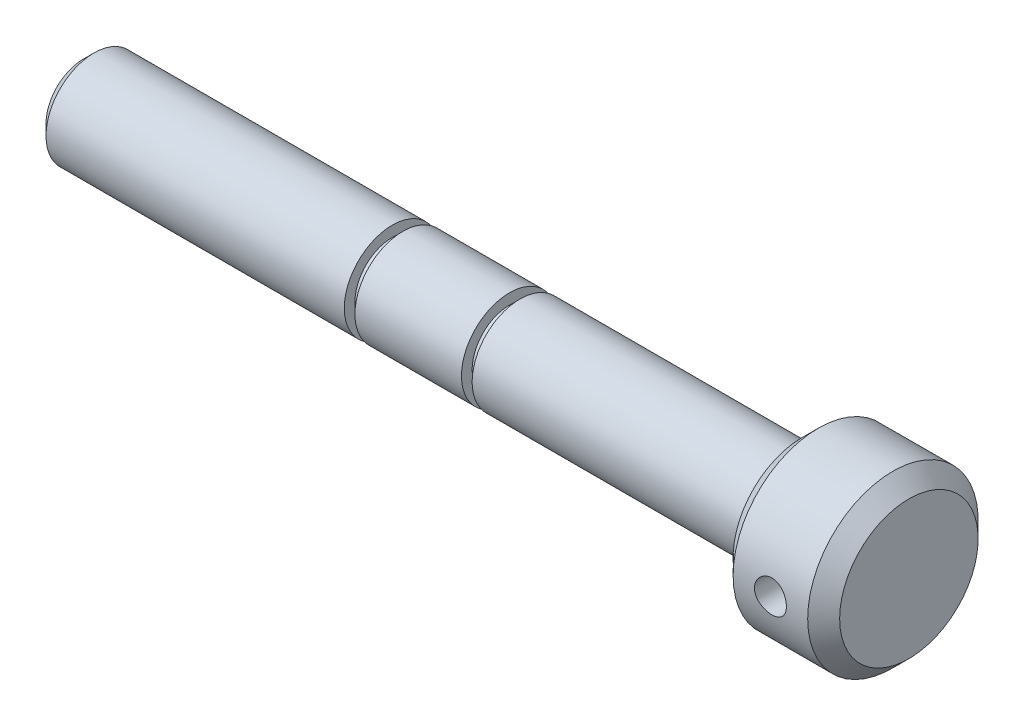
ISO-10303-21;
HEADER;
FILE_DESCRIPTION(('STEP AP214'),'2;1');
FILE_NAME('part.step','',(''),(''),'','','');
FILE_SCHEMA(('AUTOMOTIVE_DESIGN { 1 0 10303 214 1 1 1 1 }'));
ENDSEC;
DATA;
#1=APPLICATION_CONTEXT('core data for automotive mechanical design processes');
#2=APPLICATION_PROTOCOL_DEFINITION('international standard','automotive_design',2000,#1);
#3=PRODUCT_CONTEXT('',#1,'mechanical');
#4=PRODUCT('Part','Part','',(#3));
#5=PRODUCT_RELATED_PRODUCT_CATEGORY('part','',(#4));
#6=PRODUCT_DEFINITION_FORMATION('','',#4);
#7=PRODUCT_DEFINITION_CONTEXT('part definition',#1,'design');
#8=PRODUCT_DEFINITION('design','',#6,#7);
#9=PRODUCT_DEFINITION_SHAPE('','',#8);
#10=(LENGTH_UNIT() NAMED_UNIT(*) SI_UNIT(.MILLI.,.METRE.));
#11=(NAMED_UNIT(*) PLANE_ANGLE_UNIT() SI_UNIT($,.RADIAN.));
#12=(NAMED_UNIT(*) SI_UNIT($,.STERADIAN.) SOLID_ANGLE_UNIT());
#13=UNCERTAINTY_MEASURE_WITH_UNIT(LENGTH_MEASURE(1.E-05),#10,'distance_accuracy_value','');
#14=(GEOMETRIC_REPRESENTATION_CONTEXT(3) GLOBAL_UNCERTAINTY_ASSIGNED_CONTEXT((#13)) GLOBAL_UNIT_ASSIGNED_CONTEXT((#10,
#11,#12)) REPRESENTATION_CONTEXT('',''));
#15=CARTESIAN_POINT('',(0.,0.,0.));
#16=DIRECTION('',(0.,0.,1.));
#17=DIRECTION('',(1.,0.,0.));
#18=AXIS2_PLACEMENT_3D('',#15,#16,#17);
#19=CARTESIAN_POINT('',(155.,0.,0.));
#20=DIRECTION('',(-1.,0.,0.));
#21=DIRECTION('',(0.,0.,1.));
#22=AXIS2_PLACEMENT_3D('',#19,#20,#21);
#23=PLANE('',#22);
#24=CARTESIAN_POINT('',(155.,0.,0.));
#25=DIRECTION('',(-1.,0.,0.));
#26=DIRECTION('',(0.,0.,1.));
#27=AXIS2_PLACEMENT_3D('',#24,#25,#26);
#28=CIRCLE('',#27,13.);
#29=CARTESIAN_POINT('',(155.,0.,13.));
#30=VERTEX_POINT('',#29);
#31=EDGE_CURVE('E153',#30,#30,#28,.F.);
#32=ORIENTED_EDGE('',*,*,#31,.T.);
#33=EDGE_LOOP('',(#32));
#34=FACE_BOUND('',#33,.T.);
#35=ADVANCED_FACE('F45',(#34),#23,.F.);
#36=CARTESIAN_POINT('',(0.,0.,0.));
#37=DIRECTION('',(-1.,0.,0.));
#38=DIRECTION('',(0.,0.,1.));
#39=AXIS2_PLACEMENT_3D('',#36,#37,#38);
#40=CYLINDRICAL_SURFACE('',#39,16.);
#41=CARTESIAN_POINT('',(148.,0.,-16.));
#42=CARTESIAN_POINT('',(147.999993620823,0.166943492930942,-15.999996976677));
#43=CARTESIAN_POINT('',(147.986017846761,0.333969985460197,-15.9973601984343));
#44=CARTESIAN_POINT('',(147.930520009763,0.663316259683595,-15.9870957178104));
#45=CARTESIAN_POINT('',(147.88897469872,0.825631948304451,-15.9794638033379));
#46=CARTESIAN_POINT('',(147.779654597481,1.14074592370361,-15.9600627753092));
#47=CARTESIAN_POINT('',(147.711903495095,1.2935526613707,-15.9482973989297));
#48=CARTESIAN_POINT('',(147.552162246154,1.58561594618802,-15.9219142119957));
#49=CARTESIAN_POINT('',(147.46017406171,1.72487358895465,-15.9072966323658));
#50=CARTESIAN_POINT('',(147.253400463993,1.98756743186101,-15.8766267286101));
#51=CARTESIAN_POINT('',(147.13838111066,2.11081791006367,-15.860560697127));
#52=CARTESIAN_POINT('',(146.889313381825,2.33639212270738,-15.828906369173));
#53=CARTESIAN_POINT('',(146.755263640461,2.43871435378483,-15.8133181070906));
#54=CARTESIAN_POINT('',(146.470627823272,2.62029997331585,-15.7842510249001));
#55=CARTESIAN_POINT('',(146.319919259365,2.6993744393921,-15.7707898777236));
#56=CARTESIAN_POINT('',(146.007062169646,2.83101048664565,-15.7476942642397));
#57=CARTESIAN_POINT('',(145.844914631778,2.88357435426196,-15.7380594679392));
#58=CARTESIAN_POINT('',(145.515769538171,2.96010107007,-15.723845391491));
#59=CARTESIAN_POINT('',(145.348849805593,2.98438780384078,-15.7192089073281));
#60=CARTESIAN_POINT('',(145.013245230383,3.00467616190692,-15.7153439430552));
#61=CARTESIAN_POINT('',(144.844560547395,3.00068032270747,-15.7161149779752));
#62=CARTESIAN_POINT('',(144.512560949468,2.96477959204724,-15.7229258540351));
#63=CARTESIAN_POINT('',(144.3492045714,2.93324299992089,-15.7288961629467));
#64=CARTESIAN_POINT('',(144.030143160435,2.84373598792413,-15.7453236656933));
#65=CARTESIAN_POINT('',(143.874438452981,2.78576444478997,-15.7557810501903));
#66=CARTESIAN_POINT('',(143.574022641999,2.64467294358599,-15.7800771058518));
#67=CARTESIAN_POINT('',(143.429383058838,2.56140427064911,-15.7939356764673));
#68=CARTESIAN_POINT('',(143.15599054292,2.37218737860832,-15.8234594320584));
#69=CARTESIAN_POINT('',(143.02723922457,2.26623685778531,-15.8391248003104));
#70=CARTESIAN_POINT('',(142.787150088655,2.03267811370594,-15.8708000254433));
#71=CARTESIAN_POINT('',(142.676118695096,1.90475487372136,-15.8868114204806));
#72=CARTESIAN_POINT('',(142.477045518649,1.63193607419766,-15.9171477221664));
#73=CARTESIAN_POINT('',(142.389003966259,1.48704034451154,-15.9314726119049));
#74=CARTESIAN_POINT('',(142.23836449226,1.18406997774933,-15.9568507935502));
#75=CARTESIAN_POINT('',(142.175798441764,1.02597912889298,-15.9678999827258));
#76=CARTESIAN_POINT('',(142.078195813816,0.701278230797383,-15.9854501080544));
#77=CARTESIAN_POINT('',(142.043156311909,0.534669088555564,-15.9919515273599));
#78=CARTESIAN_POINT('',(142.002027937963,0.200297305806761,-15.9996072128396));
#79=CARTESIAN_POINT('',(141.99551921694,0.032588025268261,-16.0008390182456));
#80=CARTESIAN_POINT('',(142.010510959095,-0.301522496184375,-15.9980308719646));
#81=CARTESIAN_POINT('',(142.03201004613,-0.467923800960776,-15.9939911792886));
#82=CARTESIAN_POINT('',(142.102058070367,-0.793363146436439,-15.9811422300081));
#83=CARTESIAN_POINT('',(142.150394565076,-0.952448522092132,-15.9723704474806));
#84=CARTESIAN_POINT('',(142.272515413558,-1.26025726364927,-15.95103684425));
#85=CARTESIAN_POINT('',(142.346301495132,-1.4089799251902,-15.9384747662267));
#86=CARTESIAN_POINT('',(142.518156256319,-1.69363334302642,-15.9107606071533));
#87=CARTESIAN_POINT('',(142.616481477074,-1.82940655403024,-15.8955817234913));
#88=CARTESIAN_POINT('',(142.834276274725,-2.08267664652909,-15.8643868697942));
#89=CARTESIAN_POINT('',(142.953747826003,-2.20017181952174,-15.8483708216937));
#90=CARTESIAN_POINT('',(143.212344637823,-2.41514591744096,-15.817049513949));
#91=CARTESIAN_POINT('',(143.351709816251,-2.51233832437154,-15.8017565172051));
#92=CARTESIAN_POINT('',(143.645035249047,-2.68193350115574,-15.7738597115706));
#93=CARTESIAN_POINT('',(143.798994960741,-2.75433719227848,-15.761255802747));
#94=CARTESIAN_POINT('',(144.116411734485,-2.87189347025646,-15.7402604841915));
#95=CARTESIAN_POINT('',(144.279818759119,-2.91717737589572,-15.7318488087376));
#96=CARTESIAN_POINT('',(144.612094445043,-2.9796135865247,-15.7201440760483));
#97=CARTESIAN_POINT('',(144.780962487941,-2.99676906541416,-15.7168504413158));
#98=CARTESIAN_POINT('',(145.116496662883,-3.00235524296709,-15.7157839960771));
#99=CARTESIAN_POINT('',(145.283155161914,-2.99123790006997,-15.7179243194859));
#100=CARTESIAN_POINT('',(145.612182844091,-2.94158350757605,-15.7272920132));
#101=CARTESIAN_POINT('',(145.774552052855,-2.90304662178663,-15.7345193531149));
#102=CARTESIAN_POINT('',(146.090148969591,-2.79983775166526,-15.7532101604636));
#103=CARTESIAN_POINT('',(146.243393182691,-2.73521470794505,-15.7646656918993));
#104=CARTESIAN_POINT('',(146.536936508482,-2.58171737824409,-15.7905277510368));
#105=CARTESIAN_POINT('',(146.67723470569,-2.49284137896372,-15.8049344872024));
#106=CARTESIAN_POINT('',(146.943167360085,-2.29178974679071,-15.8353453221549));
#107=CARTESIAN_POINT('',(147.068550825134,-2.17928519728607,-15.8513701070609));
#108=CARTESIAN_POINT('',(147.298810324929,-1.93485585348458,-15.8830566783747));
#109=CARTESIAN_POINT('',(147.40368164196,-1.80292660378324,-15.8987183805466));
#110=CARTESIAN_POINT('',(147.590821905254,-1.52196989014375,-15.928079519361));
#111=CARTESIAN_POINT('',(147.672878856981,-1.37279918128103,-15.9417600198112));
#112=CARTESIAN_POINT('',(147.81063527321,-1.06258022730767,-15.9654323876137));
#113=CARTESIAN_POINT('',(147.866359494094,-0.901543303410499,-15.9754277175807));
#114=CARTESIAN_POINT('',(147.938554628837,-0.616694405650313,-15.9885658141526));
#115=CARTESIAN_POINT('',(147.961557260626,-0.494547620503746,-15.9928294175641));
#116=CARTESIAN_POINT('',(147.992282124233,-0.248282494230318,-15.9985475990802));
#117=CARTESIAN_POINT('',(148.000004744512,-0.12416420330542,-16.0000022485961));
#118=CARTESIAN_POINT('',(148.,0.,-16.));
#119=B_SPLINE_CURVE_WITH_KNOTS('',3,(#41,#42,#43,#44,#45,#46,#47,#48,#49,#50,#51,#52,#53,#54,
#55,#56,#57,#58,#59,#60,#61,#62,#63,#64,#65,#66,#67,#68,#69,#70,#71,#72,#73,#74,#75,#76,#77,#78,
#79,#80,#81,#82,#83,#84,#85,#86,#87,#88,#89,#90,#91,#92,#93,#94,#95,#96,#97,#98,#99,#100,#101,
#102,#103,#104,#105,#106,#107,#108,#109,#110,#111,#112,#113,#114,#115,#116,#117,#118),
.UNSPECIFIED.,.T.,.F.,(4,2,2,2,2,2,2,2,2,2,2,2,2,2,2,2,2,2,2,2,2,2,2,2,2,2,2,2,2,2,2,2,2,2,2,2,
2,2,4),(0.,0.50037640192985,1.0011752850709,1.50152254246182,2.00182930673783,2.50750236027263,
3.01321172567232,3.52292381008715,4.03259192623896,4.53636302890672,5.04008895174511,
5.53718001225533,6.03429219693572,6.53438525259059,7.03452908099719,7.54255536928152,
8.05058675089894,8.55925176643396,9.0678627334749,9.56896348152192,10.0700396092917,
10.5672046781565,11.0644035067606,11.5670355603541,12.069714568262,12.579068739746,
13.0884039790989,13.5952525563712,14.1020439389302,14.6007850446349,15.0995231708301,
15.5973299241538,16.0951718531084,16.6004673993276,17.1058790252451,17.6158409783263,
18.1253225386234,18.4974868904881,18.8696417807908),.UNSPECIFIED.);
#120=CARTESIAN_POINT('',(148.,0.,-16.));
#121=VERTEX_POINT('',#120);
#122=EDGE_CURVE('E10',#121,#121,#119,.T.);
#123=ORIENTED_EDGE('',*,*,#122,.T.);
#124=EDGE_LOOP('',(#123));
#125=FACE_BOUND('',#124,.T.);
#126=CARTESIAN_POINT('',(148.,0.,16.));
#127=CARTESIAN_POINT('',(147.999993620823,-0.166943492930942,15.999996976677));
#128=CARTESIAN_POINT('',(147.986017846761,-0.333969985460197,15.9973601984343));
#129=CARTESIAN_POINT('',(147.930520009763,-0.663316259683595,15.9870957178104));
#130=CARTESIAN_POINT('',(147.88897469872,-0.825631948304451,15.9794638033379));
#131=CARTESIAN_POINT('',(147.779654597481,-1.14074592370361,15.9600627753092));
#132=CARTESIAN_POINT('',(147.711903495095,-1.2935526613707,15.9482973989297));
#133=CARTESIAN_POINT('',(147.552162246154,-1.58561594618802,15.9219142119957));
#134=CARTESIAN_POINT('',(147.46017406171,-1.72487358895465,15.9072966323658));
#135=CARTESIAN_POINT('',(147.253400463993,-1.98756743186101,15.8766267286101));
#136=CARTESIAN_POINT('',(147.13838111066,-2.11081791006367,15.860560697127));
#137=CARTESIAN_POINT('',(146.889313381825,-2.33639212270738,15.828906369173));
#138=CARTESIAN_POINT('',(146.755263640461,-2.43871435378483,15.8133181070906));
#139=CARTESIAN_POINT('',(146.470627823272,-2.62029997331585,15.7842510249001));
#140=CARTESIAN_POINT('',(146.319919259365,-2.6993744393921,15.7707898777236));
#141=CARTESIAN_POINT('',(146.007062169646,-2.83101048664565,15.7476942642397));
#142=CARTESIAN_POINT('',(145.844914631778,-2.88357435426196,15.7380594679392));
#143=CARTESIAN_POINT('',(145.515769538171,-2.96010107007,15.723845391491));
#144=CARTESIAN_POINT('',(145.348849805593,-2.98438780384078,15.7192089073281));
#145=CARTESIAN_POINT('',(145.013245230383,-3.00467616190692,15.7153439430552));
#146=CARTESIAN_POINT('',(144.844560547395,-3.00068032270747,15.7161149779752));
#147=CARTESIAN_POINT('',(144.512560949468,-2.96477959204724,15.7229258540351));
#148=CARTESIAN_POINT('',(144.3492045714,-2.93324299992089,15.7288961629467));
#149=CARTESIAN_POINT('',(144.030143160435,-2.84373598792413,15.7453236656933));
#150=CARTESIAN_POINT('',(143.874438452981,-2.78576444478997,15.7557810501903));
#151=CARTESIAN_POINT('',(143.574022641999,-2.64467294358599,15.7800771058518));
#152=CARTESIAN_POINT('',(143.429383058838,-2.56140427064911,15.7939356764673));
#153=CARTESIAN_POINT('',(143.15599054292,-2.37218737860832,15.8234594320584));
#154=CARTESIAN_POINT('',(143.02723922457,-2.26623685778531,15.8391248003104));
#155=CARTESIAN_POINT('',(142.787150088655,-2.03267811370594,15.8708000254433));
#156=CARTESIAN_POINT('',(142.676118695096,-1.90475487372136,15.8868114204806));
#157=CARTESIAN_POINT('',(142.477045518649,-1.63193607419766,15.9171477221664));
#158=CARTESIAN_POINT('',(142.389003966259,-1.48704034451154,15.9314726119049));
#159=CARTESIAN_POINT('',(142.23836449226,-1.18406997774933,15.9568507935502));
#160=CARTESIAN_POINT('',(142.175798441764,-1.02597912889298,15.9678999827258));
#161=CARTESIAN_POINT('',(142.078195813816,-0.701278230797383,15.9854501080544));
#162=CARTESIAN_POINT('',(142.043156311909,-0.534669088555564,15.9919515273599));
#163=CARTESIAN_POINT('',(142.002027937963,-0.200297305806761,15.9996072128396));
#164=CARTESIAN_POINT('',(141.99551921694,-0.032588025268261,16.0008390182456));
#165=CARTESIAN_POINT('',(142.010510959095,0.301522496184375,15.9980308719646));
#166=CARTESIAN_POINT('',(142.03201004613,0.467923800960776,15.9939911792886));
#167=CARTESIAN_POINT('',(142.102058070367,0.793363146436439,15.9811422300081));
#168=CARTESIAN_POINT('',(142.150394565076,0.952448522092132,15.9723704474806));
#169=CARTESIAN_POINT('',(142.272515413558,1.26025726364927,15.95103684425));
#170=CARTESIAN_POINT('',(142.346301495132,1.4089799251902,15.9384747662267));
#171=CARTESIAN_POINT('',(142.518156256319,1.69363334302642,15.9107606071533));
#172=CARTESIAN_POINT('',(142.616481477074,1.82940655403024,15.8955817234913));
#173=CARTESIAN_POINT('',(142.834276274725,2.08267664652909,15.8643868697942));
#174=CARTESIAN_POINT('',(142.953747826003,2.20017181952174,15.8483708216937));
#175=CARTESIAN_POINT('',(143.212344637823,2.41514591744096,15.817049513949));
#176=CARTESIAN_POINT('',(143.351709816251,2.51233832437154,15.8017565172051));
#177=CARTESIAN_POINT('',(143.645035249047,2.68193350115574,15.7738597115706));
#178=CARTESIAN_POINT('',(143.798994960741,2.75433719227848,15.761255802747));
#179=CARTESIAN_POINT('',(144.116411734485,2.87189347025646,15.7402604841915));
#180=CARTESIAN_POINT('',(144.279818759119,2.91717737589572,15.7318488087376));
#181=CARTESIAN_POINT('',(144.612094445043,2.9796135865247,15.7201440760483));
#182=CARTESIAN_POINT('',(144.780962487941,2.99676906541416,15.7168504413158));
#183=CARTESIAN_POINT('',(145.116496662883,3.00235524296709,15.7157839960771));
#184=CARTESIAN_POINT('',(145.283155161914,2.99123790006997,15.7179243194859));
#185=CARTESIAN_POINT('',(145.612182844091,2.94158350757605,15.7272920132));
#186=CARTESIAN_POINT('',(145.774552052855,2.90304662178663,15.7345193531149));
#187=CARTESIAN_POINT('',(146.090148969591,2.79983775166526,15.7532101604636));
#188=CARTESIAN_POINT('',(146.243393182691,2.73521470794505,15.7646656918993));
#189=CARTESIAN_POINT('',(146.536936508482,2.58171737824409,15.7905277510368));
#190=CARTESIAN_POINT('',(146.67723470569,2.49284137896372,15.8049344872024));
#191=CARTESIAN_POINT('',(146.943167360085,2.29178974679071,15.8353453221549));
#192=CARTESIAN_POINT('',(147.068550825134,2.17928519728607,15.8513701070609));
#193=CARTESIAN_POINT('',(147.298810324929,1.93485585348458,15.8830566783747));
#194=CARTESIAN_POINT('',(147.40368164196,1.80292660378324,15.8987183805466));
#195=CARTESIAN_POINT('',(147.590821905254,1.52196989014375,15.928079519361));
#196=CARTESIAN_POINT('',(147.672878856981,1.37279918128103,15.9417600198112));
#197=CARTESIAN_POINT('',(147.81063527321,1.06258022730767,15.9654323876137));
#198=CARTESIAN_POINT('',(147.866359494094,0.901543303410499,15.9754277175807));
#199=CARTESIAN_POINT('',(147.938554628837,0.616694405650313,15.9885658141526));
#200=CARTESIAN_POINT('',(147.961557260626,0.494547620503746,15.9928294175641));
#201=CARTESIAN_POINT('',(147.992282124233,0.248282494230318,15.9985475990802));
#202=CARTESIAN_POINT('',(148.000004744512,0.12416420330542,16.0000022485961));
#203=CARTESIAN_POINT('',(148.,0.,16.));
#204=B_SPLINE_CURVE_WITH_KNOTS('',3,(#126,#127,#128,#129,#130,#131,#132,#133,#134,#135,#136,
#137,#138,#139,#140,#141,#142,#143,#144,#145,#146,#147,#148,#149,#150,#151,#152,#153,#154,#155,
#156,#157,#158,#159,#160,#161,#162,#163,#164,#165,#166,#167,#168,#169,#170,#171,#172,#173,#174,
#175,#176,#177,#178,#179,#180,#181,#182,#183,#184,#185,#186,#187,#188,#189,#190,#191,#192,#193,
#194,#195,#196,#197,#198,#199,#200,#201,#202,#203),.UNSPECIFIED.,.T.,.F.,(4,2,2,2,2,2,2,2,2,2,2,
2,2,2,2,2,2,2,2,2,2,2,2,2,2,2,2,2,2,2,2,2,2,2,2,2,2,2,4),(0.,0.50037640192985,1.0011752850709,
1.50152254246182,2.00182930673783,2.50750236027263,3.01321172567232,3.52292381008715,
4.03259192623896,4.53636302890672,5.04008895174511,5.53718001225533,6.03429219693572,
6.53438525259059,7.03452908099719,7.54255536928152,8.05058675089894,8.55925176643396,
9.0678627334749,9.56896348152192,10.0700396092917,10.5672046781565,11.0644035067606,
11.5670355603541,12.069714568262,12.579068739746,13.0884039790989,13.5952525563712,
14.1020439389302,14.6007850446349,15.0995231708301,15.5973299241538,16.0951718531084,
16.6004673993276,17.1058790252451,17.6158409783263,18.1253225386234,18.4974868904881,
18.8696417807908),.UNSPECIFIED.);
#205=CARTESIAN_POINT('',(148.,0.,16.));
#206=VERTEX_POINT('',#205);
#207=EDGE_CURVE('E58',#206,#206,#204,.T.);
#208=ORIENTED_EDGE('',*,*,#207,.T.);
#209=EDGE_LOOP('',(#208));
#210=FACE_BOUND('',#209,.T.);
#211=CARTESIAN_POINT('',(138.,0.,0.));
#212=DIRECTION('',(1.,0.,0.));
#213=DIRECTION('',(0.,0.,-1.));
#214=AXIS2_PLACEMENT_3D('',#211,#212,#213);
#215=CIRCLE('',#214,16.);
#216=CARTESIAN_POINT('',(138.,0.,-16.));
#217=VERTEX_POINT('',#216);
#218=EDGE_CURVE('E158',#217,#217,#215,.T.);
#219=ORIENTED_EDGE('',*,*,#218,.T.);
#220=EDGE_LOOP('',(#219));
#221=FACE_BOUND('',#220,.T.);
#222=CARTESIAN_POINT('',(152.,0.,0.));
#223=DIRECTION('',(-1.,0.,0.));
#224=DIRECTION('',(0.,0.,1.));
#225=AXIS2_PLACEMENT_3D('',#222,#223,#224);
#226=CIRCLE('',#225,16.);
#227=CARTESIAN_POINT('',(152.,0.,16.));
#228=VERTEX_POINT('',#227);
#229=EDGE_CURVE('E156',#228,#228,#226,.T.);
#230=ORIENTED_EDGE('',*,*,#229,.T.);
#231=EDGE_LOOP('',(#230));
#232=FACE_BOUND('',#231,.T.);
#233=ADVANCED_FACE('F72',(#125,#210,#221,#232),#40,.T.);
#234=CARTESIAN_POINT('',(135.,16.,0.));
#235=DIRECTION('',(1.,0.,0.));
#236=DIRECTION('',(0.,0.,-1.));
#237=AXIS2_PLACEMENT_3D('',#234,#235,#236);
#238=PLANE('',#237);
#239=CARTESIAN_POINT('',(135.,0.,0.));
#240=DIRECTION('',(1.,0.,0.));
#241=DIRECTION('',(0.,0.,-1.));
#242=AXIS2_PLACEMENT_3D('',#239,#240,#241);
#243=CIRCLE('',#242,13.);
#244=CARTESIAN_POINT('',(135.,0.,-13.));
#245=VERTEX_POINT('',#244);
#246=EDGE_CURVE('E159',#245,#245,#243,.F.);
#247=ORIENTED_EDGE('',*,*,#246,.T.);
#248=EDGE_LOOP('',(#247));
#249=FACE_BOUND('',#248,.T.);
#250=CARTESIAN_POINT('',(135.,0.,0.));
#251=DIRECTION('',(-1.,0.,0.));
#252=DIRECTION('',(0.,0.,1.));
#253=AXIS2_PLACEMENT_3D('',#250,#251,#252);
#254=CIRCLE('',#253,9.00000000000002);
#255=CARTESIAN_POINT('',(135.,0.,9.00000000000002));
#256=VERTEX_POINT('',#255);
#257=EDGE_CURVE('E163',#256,#256,#254,.T.);
#258=ORIENTED_EDGE('',*,*,#257,.F.);
#259=EDGE_LOOP('',(#258));
#260=FACE_BOUND('',#259,.T.);
#261=ADVANCED_FACE('F121',(#249,#260),#238,.F.);
#262=CARTESIAN_POINT('',(0.,0.,0.));
#263=DIRECTION('',(-1.,0.,0.));
#264=DIRECTION('',(0.,0.,1.));
#265=AXIS2_PLACEMENT_3D('',#262,#263,#264);
#266=CYLINDRICAL_SURFACE('',#265,9.00000000000001);
#267=CARTESIAN_POINT('',(82.,0.,0.));
#268=DIRECTION('',(-1.,0.,0.));
#269=DIRECTION('',(0.,0.,1.));
#270=AXIS2_PLACEMENT_3D('',#267,#268,#269);
#271=CIRCLE('',#270,9.00000000000001);
#272=CARTESIAN_POINT('',(82.,0.,9.00000000000001));
#273=VERTEX_POINT('',#272);
#274=EDGE_CURVE('E172',#273,#273,#271,.T.);
#275=ORIENTED_EDGE('',*,*,#274,.F.);
#276=EDGE_LOOP('',(#275));
#277=FACE_BOUND('',#276,.T.);
#278=ORIENTED_EDGE('',*,*,#257,.T.);
#279=EDGE_LOOP('',(#278));
#280=FACE_BOUND('',#279,.T.);
#281=ADVANCED_FACE('F118',(#277,#280),#266,.T.);
#282=CARTESIAN_POINT('',(82.,9.00000000000001,0.));
#283=DIRECTION('',(1.,0.,0.));
#284=DIRECTION('',(0.,0.,-1.));
#285=AXIS2_PLACEMENT_3D('',#282,#283,#284);
#286=PLANE('',#285);
#287=CARTESIAN_POINT('',(82.,0.,0.));
#288=DIRECTION('',(-1.,0.,0.));
#289=DIRECTION('',(0.,0.,1.));
#290=AXIS2_PLACEMENT_3D('',#287,#288,#289);
#291=CIRCLE('',#290,7.);
#292=CARTESIAN_POINT('',(82.,0.,7.));
#293=VERTEX_POINT('',#292);
#294=EDGE_CURVE('E175',#293,#293,#291,.T.);
#295=ORIENTED_EDGE('',*,*,#294,.F.);
#296=EDGE_LOOP('',(#295));
#297=FACE_BOUND('',#296,.T.);
#298=ORIENTED_EDGE('',*,*,#274,.T.);
#299=EDGE_LOOP('',(#298));
#300=FACE_BOUND('',#299,.T.);
#301=ADVANCED_FACE('F114',(#297,#300),#286,.F.);
#302=CARTESIAN_POINT('',(0.,0.,0.));
#303=DIRECTION('',(-1.,0.,0.));
#304=DIRECTION('',(0.,0.,1.));
#305=AXIS2_PLACEMENT_3D('',#302,#303,#304);
#306=CYLINDRICAL_SURFACE('',#305,7.);
#307=CARTESIAN_POINT('',(80.,0.,0.));
#308=DIRECTION('',(-1.,0.,0.));
#309=DIRECTION('',(0.,0.,1.));
#310=AXIS2_PLACEMENT_3D('',#307,#308,#309);
#311=CIRCLE('',#310,7.);
#312=CARTESIAN_POINT('',(80.,0.,7.));
#313=VERTEX_POINT('',#312);
#314=EDGE_CURVE('E178',#313,#313,#311,.T.);
#315=ORIENTED_EDGE('',*,*,#314,.F.);
#316=EDGE_LOOP('',(#315));
#317=FACE_BOUND('',#316,.T.);
#318=ORIENTED_EDGE('',*,*,#294,.T.);
#319=EDGE_LOOP('',(#318));
#320=FACE_BOUND('',#319,.T.);
#321=ADVANCED_FACE('F110',(#317,#320),#306,.T.);
#322=CARTESIAN_POINT('',(80.,7.,0.));
#323=DIRECTION('',(-1.,0.,0.));
#324=DIRECTION('',(0.,0.,1.));
#325=AXIS2_PLACEMENT_3D('',#322,#323,#324);
#326=PLANE('',#325);
#327=CARTESIAN_POINT('',(80.,0.,0.));
#328=DIRECTION('',(-1.,0.,0.));
#329=DIRECTION('',(0.,0.,1.));
#330=AXIS2_PLACEMENT_3D('',#327,#328,#329);
#331=CIRCLE('',#330,9.00000000000001);
#332=CARTESIAN_POINT('',(80.,0.,9.00000000000001));
#333=VERTEX_POINT('',#332);
#334=EDGE_CURVE('E181',#333,#333,#331,.T.);
#335=ORIENTED_EDGE('',*,*,#334,.F.);
#336=EDGE_LOOP('',(#335));
#337=FACE_BOUND('',#336,.T.);
#338=ORIENTED_EDGE('',*,*,#314,.T.);
#339=EDGE_LOOP('',(#338));
#340=FACE_BOUND('',#339,.T.);
#341=ADVANCED_FACE('F106',(#337,#340),#326,.F.);
#342=CARTESIAN_POINT('',(0.,0.,0.));
#343=DIRECTION('',(-1.,0.,0.));
#344=DIRECTION('',(0.,0.,1.));
#345=AXIS2_PLACEMENT_3D('',#342,#343,#344);
#346=CYLINDRICAL_SURFACE('',#345,9.00000000000001);
#347=CARTESIAN_POINT('',(60.,0.,0.));
#348=DIRECTION('',(-1.,0.,0.));
#349=DIRECTION('',(0.,0.,1.));
#350=AXIS2_PLACEMENT_3D('',#347,#348,#349);
#351=CIRCLE('',#350,9.00000000000001);
#352=CARTESIAN_POINT('',(60.,0.,9.00000000000001));
#353=VERTEX_POINT('',#352);
#354=EDGE_CURVE('E184',#353,#353,#351,.T.);
#355=ORIENTED_EDGE('',*,*,#354,.F.);
#356=EDGE_LOOP('',(#355));
#357=FACE_BOUND('',#356,.T.);
#358=ORIENTED_EDGE('',*,*,#334,.T.);
#359=EDGE_LOOP('',(#358));
#360=FACE_BOUND('',#359,.T.);
#361=ADVANCED_FACE('F102',(#357,#360),#346,.T.);
#362=CARTESIAN_POINT('',(60.,9.00000000000001,0.));
#363=DIRECTION('',(1.,0.,0.));
#364=DIRECTION('',(0.,0.,-1.));
#365=AXIS2_PLACEMENT_3D('',#362,#363,#364);
#366=PLANE('',#365);
#367=CARTESIAN_POINT('',(60.,0.,0.));
#368=DIRECTION('',(-1.,0.,0.));
#369=DIRECTION('',(0.,0.,1.));
#370=AXIS2_PLACEMENT_3D('',#367,#368,#369);
#371=CIRCLE('',#370,7.);
#372=CARTESIAN_POINT('',(60.,0.,7.));
#373=VERTEX_POINT('',#372);
#374=EDGE_CURVE('E187',#373,#373,#371,.T.);
#375=ORIENTED_EDGE('',*,*,#374,.F.);
#376=EDGE_LOOP('',(#375));
#377=FACE_BOUND('',#376,.T.);
#378=ORIENTED_EDGE('',*,*,#354,.T.);
#379=EDGE_LOOP('',(#378));
#380=FACE_BOUND('',#379,.T.);
#381=ADVANCED_FACE('F98',(#377,#380),#366,.F.);
#382=CARTESIAN_POINT('',(0.,0.,0.));
#383=DIRECTION('',(-1.,0.,0.));
#384=DIRECTION('',(0.,0.,1.));
#385=AXIS2_PLACEMENT_3D('',#382,#383,#384);
#386=CYLINDRICAL_SURFACE('',#385,7.);
#387=CARTESIAN_POINT('',(58.,0.,0.));
#388=DIRECTION('',(-1.,0.,0.));
#389=DIRECTION('',(0.,0.,1.));
#390=AXIS2_PLACEMENT_3D('',#387,#388,#389);
#391=CIRCLE('',#390,7.);
#392=CARTESIAN_POINT('',(58.,0.,7.));
#393=VERTEX_POINT('',#392);
#394=EDGE_CURVE('E190',#393,#393,#391,.T.);
#395=ORIENTED_EDGE('',*,*,#394,.F.);
#396=EDGE_LOOP('',(#395));
#397=FACE_BOUND('',#396,.T.);
#398=ORIENTED_EDGE('',*,*,#374,.T.);
#399=EDGE_LOOP('',(#398));
#400=FACE_BOUND('',#399,.T.);
#401=ADVANCED_FACE('F94',(#397,#400),#386,.T.);
#402=CARTESIAN_POINT('',(58.,7.,0.));
#403=DIRECTION('',(-1.,0.,0.));
#404=DIRECTION('',(0.,0.,1.));
#405=AXIS2_PLACEMENT_3D('',#402,#403,#404);
#406=PLANE('',#405);
#407=CARTESIAN_POINT('',(58.,0.,0.));
#408=DIRECTION('',(-1.,0.,0.));
#409=DIRECTION('',(0.,0.,1.));
#410=AXIS2_PLACEMENT_3D('',#407,#408,#409);
#411=CIRCLE('',#410,9.00000000000001);
#412=CARTESIAN_POINT('',(58.,0.,9.00000000000001));
#413=VERTEX_POINT('',#412);
#414=EDGE_CURVE('E193',#413,#413,#411,.T.);
#415=ORIENTED_EDGE('',*,*,#414,.F.);
#416=EDGE_LOOP('',(#415));
#417=FACE_BOUND('',#416,.T.);
#418=ORIENTED_EDGE('',*,*,#394,.T.);
#419=EDGE_LOOP('',(#418));
#420=FACE_BOUND('',#419,.T.);
#421=ADVANCED_FACE('F90',(#417,#420),#406,.F.);
#422=CARTESIAN_POINT('',(0.,0.,0.));
#423=DIRECTION('',(-1.,0.,0.));
#424=DIRECTION('',(0.,0.,1.));
#425=AXIS2_PLACEMENT_3D('',#422,#423,#424);
#426=CYLINDRICAL_SURFACE('',#425,9.);
#427=CARTESIAN_POINT('',(2.00000000000001,0.,0.));
#428=DIRECTION('',(1.,0.,0.));
#429=DIRECTION('',(0.,0.,-1.));
#430=AXIS2_PLACEMENT_3D('',#427,#428,#429);
#431=CIRCLE('',#430,9.);
#432=CARTESIAN_POINT('',(2.00000000000001,0.,-9.));
#433=VERTEX_POINT('',#432);
#434=EDGE_CURVE('E62',#433,#433,#431,.T.);
#435=ORIENTED_EDGE('',*,*,#434,.T.);
#436=EDGE_LOOP('',(#435));
#437=FACE_BOUND('',#436,.T.);
#438=ORIENTED_EDGE('',*,*,#414,.T.);
#439=EDGE_LOOP('',(#438));
#440=FACE_BOUND('',#439,.T.);
#441=ADVANCED_FACE('F86',(#437,#440),#426,.T.);
#442=CARTESIAN_POINT('',(0.,9.,0.));
#443=DIRECTION('',(1.,0.,0.));
#444=DIRECTION('',(0.,0.,-1.));
#445=AXIS2_PLACEMENT_3D('',#442,#443,#444);
#446=PLANE('',#445);
#447=CARTESIAN_POINT('',(0.,0.,0.));
#448=DIRECTION('',(1.,0.,0.));
#449=DIRECTION('',(0.,0.,-1.));
#450=AXIS2_PLACEMENT_3D('',#447,#448,#449);
#451=CIRCLE('',#450,7.00000000000001);
#452=CARTESIAN_POINT('',(0.,0.,-7.00000000000001));
#453=VERTEX_POINT('',#452);
#454=EDGE_CURVE('E66',#453,#453,#451,.F.);
#455=ORIENTED_EDGE('',*,*,#454,.T.);
#456=EDGE_LOOP('',(#455));
#457=FACE_BOUND('',#456,.T.);
#458=ADVANCED_FACE('F81',(#457),#446,.F.);
#459=CARTESIAN_POINT('',(135.,0.,0.));
#460=DIRECTION('',(1.,0.,0.));
#461=DIRECTION('',(0.,0.,-1.));
#462=AXIS2_PLACEMENT_3D('',#459,#460,#461);
#463=CONICAL_SURFACE('',#462,13.,0.785398163397451);
#464=ORIENTED_EDGE('',*,*,#218,.F.);
#465=EDGE_LOOP('',(#464));
#466=FACE_BOUND('',#465,.T.);
#467=ORIENTED_EDGE('',*,*,#246,.F.);
#468=EDGE_LOOP('',(#467));
#469=FACE_BOUND('',#468,.T.);
#470=ADVANCED_FACE('F85',(#466,#469),#463,.T.);
#471=CARTESIAN_POINT('',(152.,0.,0.));
#472=DIRECTION('',(-1.,0.,0.));
#473=DIRECTION('',(0.,0.,1.));
#474=AXIS2_PLACEMENT_3D('',#471,#472,#473);
#475=CONICAL_SURFACE('',#474,16.,0.785398163397444);
#476=ORIENTED_EDGE('',*,*,#31,.F.);
#477=EDGE_LOOP('',(#476));
#478=FACE_BOUND('',#477,.T.);
#479=ORIENTED_EDGE('',*,*,#229,.F.);
#480=EDGE_LOOP('',(#479));
#481=FACE_BOUND('',#480,.T.);
#482=ADVANCED_FACE('F141',(#478,#481),#475,.T.);
#483=CARTESIAN_POINT('',(0.,0.,0.));
#484=DIRECTION('',(1.,0.,0.));
#485=DIRECTION('',(0.,0.,-1.));
#486=AXIS2_PLACEMENT_3D('',#483,#484,#485);
#487=CONICAL_SURFACE('',#486,7.00000000000001,0.785398163397444);
#488=ORIENTED_EDGE('',*,*,#434,.F.);
#489=EDGE_LOOP('',(#488));
#490=FACE_BOUND('',#489,.T.);
#491=ORIENTED_EDGE('',*,*,#454,.F.);
#492=EDGE_LOOP('',(#491));
#493=FACE_BOUND('',#492,.T.);
#494=ADVANCED_FACE('F48',(#490,#493),#487,.T.);
#495=CARTESIAN_POINT('',(145.,0.,-16.));
#496=DIRECTION('',(0.,0.,1.));
#497=DIRECTION('',(1.,0.,0.));
#498=AXIS2_PLACEMENT_3D('',#495,#496,#497);
#499=CYLINDRICAL_SURFACE('',#498,2.99999999999999);
#500=ORIENTED_EDGE('',*,*,#207,.F.);
#501=EDGE_LOOP('',(#500));
#502=FACE_BOUND('',#501,.T.);
#503=ORIENTED_EDGE('',*,*,#122,.F.);
#504=EDGE_LOOP('',(#503));
#505=FACE_BOUND('',#504,.T.);
#506=ADVANCED_FACE('F76',(#502,#505),#499,.F.);
#507=CLOSED_SHELL('',(#35,#233,#261,#281,#301,#321,#341,#361,#381,#401,#421,#441,#458,#470,#482,
#494,#506));
#508=MANIFOLD_SOLID_BREP('B2',#507);
#509=ADVANCED_BREP_SHAPE_REPRESENTATION('',(#18,#508),#14);
#510=SHAPE_DEFINITION_REPRESENTATION(#9,#509);
ENDSEC;
END-ISO-10303-21;
